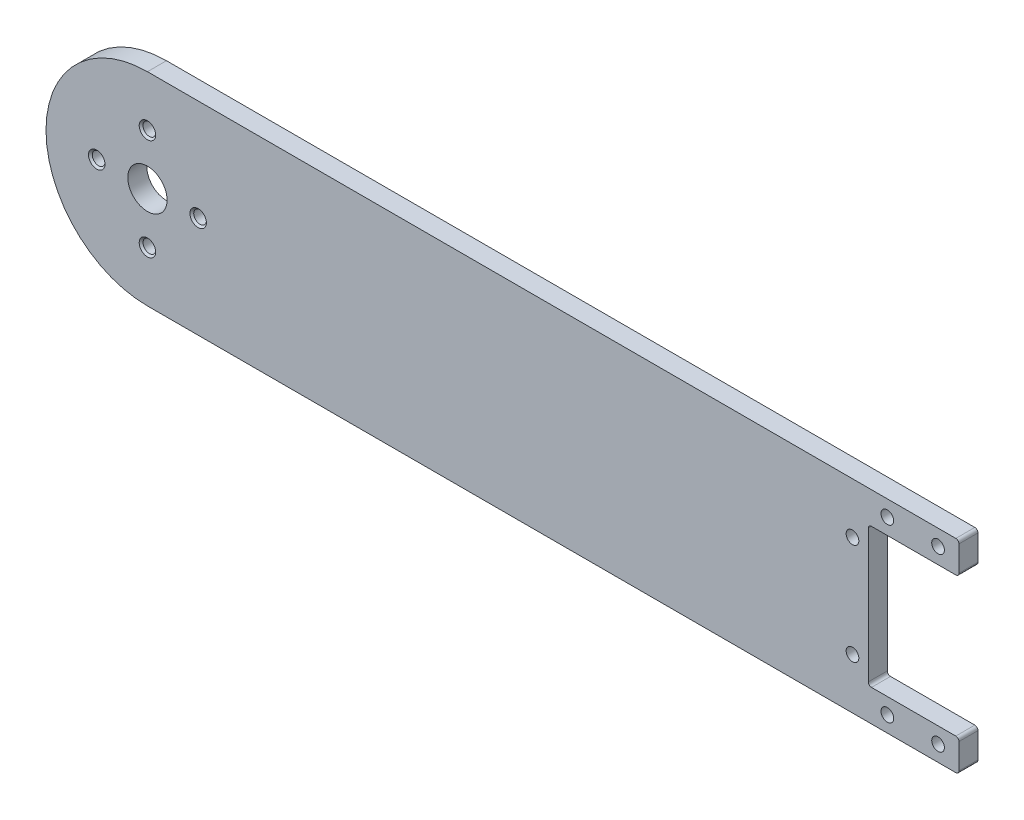
ISO-10303-21;
HEADER;
FILE_DESCRIPTION(('STEP AP214'),'2;1');
FILE_NAME('part.step','',(''),(''),'','','');
FILE_SCHEMA(('AUTOMOTIVE_DESIGN { 1 0 10303 214 1 1 1 1 }'));
ENDSEC;
DATA;
#1=APPLICATION_CONTEXT('core data for automotive mechanical design processes');
#2=APPLICATION_PROTOCOL_DEFINITION('international standard','automotive_design',2000,#1);
#3=PRODUCT_CONTEXT('',#1,'mechanical');
#4=PRODUCT('Part','Part','',(#3));
#5=PRODUCT_RELATED_PRODUCT_CATEGORY('part','',(#4));
#6=PRODUCT_DEFINITION_FORMATION('','',#4);
#7=PRODUCT_DEFINITION_CONTEXT('part definition',#1,'design');
#8=PRODUCT_DEFINITION('design','',#6,#7);
#9=PRODUCT_DEFINITION_SHAPE('','',#8);
#10=(LENGTH_UNIT() NAMED_UNIT(*) SI_UNIT(.MILLI.,.METRE.));
#11=(NAMED_UNIT(*) PLANE_ANGLE_UNIT() SI_UNIT($,.RADIAN.));
#12=(NAMED_UNIT(*) SI_UNIT($,.STERADIAN.) SOLID_ANGLE_UNIT());
#13=UNCERTAINTY_MEASURE_WITH_UNIT(LENGTH_MEASURE(1.E-05),#10,'distance_accuracy_value','');
#14=(GEOMETRIC_REPRESENTATION_CONTEXT(3) GLOBAL_UNCERTAINTY_ASSIGNED_CONTEXT((#13)) GLOBAL_UNIT_ASSIGNED_CONTEXT((#10,
#11,#12)) REPRESENTATION_CONTEXT('',''));
#15=CARTESIAN_POINT('',(0.,0.,0.));
#16=DIRECTION('',(0.,0.,1.));
#17=DIRECTION('',(1.,0.,0.));
#18=AXIS2_PLACEMENT_3D('',#15,#16,#17);
#19=CARTESIAN_POINT('',(0.,0.,3.));
#20=DIRECTION('',(0.,0.,1.));
#21=DIRECTION('',(1.,0.,0.));
#22=AXIS2_PLACEMENT_3D('',#19,#20,#21);
#23=PLANE('',#22);
#24=DIRECTION('',(1.,0.,0.));
#25=VECTOR('',#24,1.);
#26=CARTESIAN_POINT('',(0.,-16.,3.));
#27=LINE('',#26,#25);
#28=CARTESIAN_POINT('',(-61.,-16.,3.));
#29=VERTEX_POINT('',#28);
#30=CARTESIAN_POINT('',(66.4999999999998,-16.,3.));
#31=VERTEX_POINT('',#30);
#32=EDGE_CURVE('E230',#29,#31,#27,.T.);
#33=ORIENTED_EDGE('',*,*,#32,.T.);
#34=CARTESIAN_POINT('',(66.4999999999998,-15.5,3.));
#35=DIRECTION('',(0.,0.,1.));
#36=DIRECTION('',(1.,0.,0.));
#37=AXIS2_PLACEMENT_3D('',#34,#35,#36);
#38=CIRCLE('',#37,0.5);
#39=CARTESIAN_POINT('',(66.9999999999998,-15.5,3.));
#40=VERTEX_POINT('',#39);
#41=EDGE_CURVE('E278',#31,#40,#38,.T.);
#42=ORIENTED_EDGE('',*,*,#41,.T.);
#43=DIRECTION('',(0.,-1.,0.));
#44=VECTOR('',#43,1.);
#45=CARTESIAN_POINT('',(66.9999999999998,0.,3.));
#46=LINE('',#45,#44);
#47=CARTESIAN_POINT('',(66.9999999999998,-11.5,3.));
#48=VERTEX_POINT('',#47);
#49=EDGE_CURVE('E454',#48,#40,#46,.T.);
#50=ORIENTED_EDGE('',*,*,#49,.F.);
#51=CARTESIAN_POINT('',(66.4999999999998,-11.5,3.));
#52=DIRECTION('',(0.,0.,1.));
#53=DIRECTION('',(1.,0.,0.));
#54=AXIS2_PLACEMENT_3D('',#51,#52,#53);
#55=CIRCLE('',#54,0.5);
#56=CARTESIAN_POINT('',(66.4999999999998,-11.,3.));
#57=VERTEX_POINT('',#56);
#58=EDGE_CURVE('E276',#48,#57,#55,.T.);
#59=ORIENTED_EDGE('',*,*,#58,.T.);
#60=DIRECTION('',(1.,0.,0.));
#61=VECTOR('',#60,1.);
#62=CARTESIAN_POINT('',(74.9999999999998,-11.,3.));
#63=LINE('',#62,#61);
#64=CARTESIAN_POINT('',(53.1999999999998,-11.,3.));
#65=VERTEX_POINT('',#64);
#66=EDGE_CURVE('E294',#65,#57,#63,.T.);
#67=ORIENTED_EDGE('',*,*,#66,.F.);
#68=CARTESIAN_POINT('',(53.1999999999998,-10.5,3.));
#69=DIRECTION('',(0.,0.,1.));
#70=DIRECTION('',(1.,0.,0.));
#71=AXIS2_PLACEMENT_3D('',#68,#69,#70);
#72=CIRCLE('',#71,0.5);
#73=CARTESIAN_POINT('',(52.6999999999998,-10.5,3.));
#74=VERTEX_POINT('',#73);
#75=EDGE_CURVE('E116',#65,#74,#72,.F.);
#76=ORIENTED_EDGE('',*,*,#75,.T.);
#77=DIRECTION('',(0.,-1.,0.));
#78=VECTOR('',#77,1.);
#79=CARTESIAN_POINT('',(52.6999999999998,11.,3.));
#80=LINE('',#79,#78);
#81=CARTESIAN_POINT('',(52.6999999999998,10.5,3.));
#82=VERTEX_POINT('',#81);
#83=EDGE_CURVE('E292',#82,#74,#80,.T.);
#84=ORIENTED_EDGE('',*,*,#83,.F.);
#85=CARTESIAN_POINT('',(53.1999999999998,10.5,3.));
#86=DIRECTION('',(0.,0.,1.));
#87=DIRECTION('',(1.,0.,0.));
#88=AXIS2_PLACEMENT_3D('',#85,#86,#87);
#89=CIRCLE('',#88,0.5);
#90=CARTESIAN_POINT('',(53.1999999999998,11.,3.));
#91=VERTEX_POINT('',#90);
#92=EDGE_CURVE('E286',#82,#91,#89,.F.);
#93=ORIENTED_EDGE('',*,*,#92,.T.);
#94=DIRECTION('',(-1.,0.,0.));
#95=VECTOR('',#94,1.);
#96=CARTESIAN_POINT('',(74.9999999999998,11.,3.));
#97=LINE('',#96,#95);
#98=CARTESIAN_POINT('',(66.4999999999998,11.,3.));
#99=VERTEX_POINT('',#98);
#100=EDGE_CURVE('E303',#99,#91,#97,.T.);
#101=ORIENTED_EDGE('',*,*,#100,.F.);
#102=CARTESIAN_POINT('',(66.4999999999998,11.5,3.));
#103=DIRECTION('',(0.,0.,1.));
#104=DIRECTION('',(1.,0.,0.));
#105=AXIS2_PLACEMENT_3D('',#102,#103,#104);
#106=CIRCLE('',#105,0.5);
#107=CARTESIAN_POINT('',(66.9999999999998,11.5,3.));
#108=VERTEX_POINT('',#107);
#109=EDGE_CURVE('E129',#99,#108,#106,.T.);
#110=ORIENTED_EDGE('',*,*,#109,.T.);
#111=CARTESIAN_POINT('',(66.9999999999998,15.5,3.));
#112=VERTEX_POINT('',#111);
#113=EDGE_CURVE('E449',#112,#108,#46,.T.);
#114=ORIENTED_EDGE('',*,*,#113,.F.);
#115=CARTESIAN_POINT('',(66.4999999999998,15.5,3.));
#116=DIRECTION('',(0.,0.,1.));
#117=DIRECTION('',(1.,0.,0.));
#118=AXIS2_PLACEMENT_3D('',#115,#116,#117);
#119=CIRCLE('',#118,0.5);
#120=CARTESIAN_POINT('',(66.4999999999998,16.,3.));
#121=VERTEX_POINT('',#120);
#122=EDGE_CURVE('E123',#112,#121,#119,.T.);
#123=ORIENTED_EDGE('',*,*,#122,.T.);
#124=DIRECTION('',(1.,0.,0.));
#125=VECTOR('',#124,1.);
#126=CARTESIAN_POINT('',(0.,16.,3.));
#127=LINE('',#126,#125);
#128=CARTESIAN_POINT('',(-61.,16.,3.));
#129=VERTEX_POINT('',#128);
#130=EDGE_CURVE('E212',#129,#121,#127,.T.);
#131=ORIENTED_EDGE('',*,*,#130,.F.);
#132=CARTESIAN_POINT('',(-61.,0.,3.));
#133=DIRECTION('',(0.,0.,1.));
#134=DIRECTION('',(1.,0.,0.));
#135=AXIS2_PLACEMENT_3D('',#132,#133,#134);
#136=CIRCLE('',#135,16.);
#137=EDGE_CURVE('E223',#129,#29,#136,.T.);
#138=ORIENTED_EDGE('',*,*,#137,.T.);
#139=EDGE_LOOP('',(#33,#42,#50,#59,#67,#76,#84,#93,#101,#110,#114,#123,#131,#138));
#140=FACE_BOUND('',#139,.T.);
#141=CARTESIAN_POINT('',(50.1999999999998,-8.,3.));
#142=DIRECTION('',(0.,0.,-1.));
#143=DIRECTION('',(-1.,0.,0.));
#144=AXIS2_PLACEMENT_3D('',#141,#142,#143);
#145=CIRCLE('',#144,1.);
#146=CARTESIAN_POINT('',(49.1999999999998,-8.,3.));
#147=VERTEX_POINT('',#146);
#148=EDGE_CURVE('E411',#147,#147,#145,.T.);
#149=ORIENTED_EDGE('',*,*,#148,.T.);
#150=EDGE_LOOP('',(#149));
#151=FACE_BOUND('',#150,.T.);
#152=CARTESIAN_POINT('',(55.6999999999998,-13.5,3.));
#153=DIRECTION('',(0.,0.,-1.));
#154=DIRECTION('',(-1.,0.,0.));
#155=AXIS2_PLACEMENT_3D('',#152,#153,#154);
#156=CIRCLE('',#155,1.);
#157=CARTESIAN_POINT('',(54.6999999999998,-13.5,3.));
#158=VERTEX_POINT('',#157);
#159=EDGE_CURVE('E420',#158,#158,#156,.T.);
#160=ORIENTED_EDGE('',*,*,#159,.T.);
#161=EDGE_LOOP('',(#160));
#162=FACE_BOUND('',#161,.T.);
#163=CARTESIAN_POINT('',(63.6999999999998,-13.5,3.));
#164=DIRECTION('',(0.,0.,-1.));
#165=DIRECTION('',(-1.,0.,0.));
#166=AXIS2_PLACEMENT_3D('',#163,#164,#165);
#167=CIRCLE('',#166,1.);
#168=CARTESIAN_POINT('',(62.6999999999998,-13.5,3.));
#169=VERTEX_POINT('',#168);
#170=EDGE_CURVE('E327',#169,#169,#167,.T.);
#171=ORIENTED_EDGE('',*,*,#170,.T.);
#172=EDGE_LOOP('',(#171));
#173=FACE_BOUND('',#172,.T.);
#174=CARTESIAN_POINT('',(-61.,8.,3.));
#175=DIRECTION('',(0.,0.,1.));
#176=DIRECTION('',(1.,0.,0.));
#177=AXIS2_PLACEMENT_3D('',#174,#175,#176);
#178=CIRCLE('',#177,1.3);
#179=CARTESIAN_POINT('',(-59.7,8.,3.));
#180=VERTEX_POINT('',#179);
#181=EDGE_CURVE('E317',#180,#180,#178,.T.);
#182=ORIENTED_EDGE('',*,*,#181,.F.);
#183=EDGE_LOOP('',(#182));
#184=FACE_BOUND('',#183,.T.);
#185=CARTESIAN_POINT('',(-53.,0.,3.));
#186=DIRECTION('',(0.,0.,1.));
#187=DIRECTION('',(1.,0.,0.));
#188=AXIS2_PLACEMENT_3D('',#185,#186,#187);
#189=CIRCLE('',#188,1.3);
#190=CARTESIAN_POINT('',(-51.7,0.,3.));
#191=VERTEX_POINT('',#190);
#192=EDGE_CURVE('E335',#191,#191,#189,.T.);
#193=ORIENTED_EDGE('',*,*,#192,.F.);
#194=EDGE_LOOP('',(#193));
#195=FACE_BOUND('',#194,.T.);
#196=CARTESIAN_POINT('',(-61.,-8.,3.));
#197=DIRECTION('',(0.,0.,1.));
#198=DIRECTION('',(1.,0.,0.));
#199=AXIS2_PLACEMENT_3D('',#196,#197,#198);
#200=CIRCLE('',#199,1.3);
#201=CARTESIAN_POINT('',(-59.7,-8.,3.));
#202=VERTEX_POINT('',#201);
#203=EDGE_CURVE('E344',#202,#202,#200,.T.);
#204=ORIENTED_EDGE('',*,*,#203,.F.);
#205=EDGE_LOOP('',(#204));
#206=FACE_BOUND('',#205,.T.);
#207=CARTESIAN_POINT('',(-69.,0.,3.));
#208=DIRECTION('',(0.,0.,1.));
#209=DIRECTION('',(1.,0.,0.));
#210=AXIS2_PLACEMENT_3D('',#207,#208,#209);
#211=CIRCLE('',#210,1.3);
#212=CARTESIAN_POINT('',(-67.7,0.,3.));
#213=VERTEX_POINT('',#212);
#214=EDGE_CURVE('E353',#213,#213,#211,.T.);
#215=ORIENTED_EDGE('',*,*,#214,.F.);
#216=EDGE_LOOP('',(#215));
#217=FACE_BOUND('',#216,.T.);
#218=CARTESIAN_POINT('',(-61.,0.,3.));
#219=DIRECTION('',(0.,0.,1.));
#220=DIRECTION('',(1.,0.,0.));
#221=AXIS2_PLACEMENT_3D('',#218,#219,#220);
#222=CIRCLE('',#221,3.1);
#223=CARTESIAN_POINT('',(-57.9,0.,3.));
#224=VERTEX_POINT('',#223);
#225=EDGE_CURVE('E237',#224,#224,#222,.T.);
#226=ORIENTED_EDGE('',*,*,#225,.F.);
#227=EDGE_LOOP('',(#226));
#228=FACE_BOUND('',#227,.T.);
#229=CARTESIAN_POINT('',(50.1999999999998,8.,3.));
#230=DIRECTION('',(0.,0.,-1.));
#231=DIRECTION('',(-1.,0.,0.));
#232=AXIS2_PLACEMENT_3D('',#229,#230,#231);
#233=CIRCLE('',#232,1.);
#234=CARTESIAN_POINT('',(49.1999999999998,8.,3.));
#235=VERTEX_POINT('',#234);
#236=EDGE_CURVE('E375',#235,#235,#233,.T.);
#237=ORIENTED_EDGE('',*,*,#236,.T.);
#238=EDGE_LOOP('',(#237));
#239=FACE_BOUND('',#238,.T.);
#240=CARTESIAN_POINT('',(55.6999999999998,13.5,3.));
#241=DIRECTION('',(0.,0.,-1.));
#242=DIRECTION('',(-1.,0.,0.));
#243=AXIS2_PLACEMENT_3D('',#240,#241,#242);
#244=CIRCLE('',#243,1.);
#245=CARTESIAN_POINT('',(54.6999999999998,13.5,3.));
#246=VERTEX_POINT('',#245);
#247=EDGE_CURVE('E379',#246,#246,#244,.T.);
#248=ORIENTED_EDGE('',*,*,#247,.T.);
#249=EDGE_LOOP('',(#248));
#250=FACE_BOUND('',#249,.T.);
#251=CARTESIAN_POINT('',(63.6999999999998,13.5,3.));
#252=DIRECTION('',(0.,0.,-1.));
#253=DIRECTION('',(-1.,0.,0.));
#254=AXIS2_PLACEMENT_3D('',#251,#252,#253);
#255=CIRCLE('',#254,1.);
#256=CARTESIAN_POINT('',(62.6999999999998,13.5,3.));
#257=VERTEX_POINT('',#256);
#258=EDGE_CURVE('E382',#257,#257,#255,.T.);
#259=ORIENTED_EDGE('',*,*,#258,.T.);
#260=EDGE_LOOP('',(#259));
#261=FACE_BOUND('',#260,.T.);
#262=ADVANCED_FACE('F108',(#140,#151,#162,#173,#184,#195,#206,#217,#228,#239,#250,#261),#23,.T.);
#263=CARTESIAN_POINT('',(0.,16.,3.));
#264=DIRECTION('',(0.,1.,0.));
#265=DIRECTION('',(0.,0.,1.));
#266=AXIS2_PLACEMENT_3D('',#263,#264,#265);
#267=PLANE('',#266);
#268=ORIENTED_EDGE('',*,*,#130,.T.);
#269=DIRECTION('',(0.,0.,-1.));
#270=VECTOR('',#269,1.);
#271=CARTESIAN_POINT('',(66.4999999999998,16.,0.));
#272=LINE('',#271,#270);
#273=CARTESIAN_POINT('',(66.4999999999998,16.,0.));
#274=VERTEX_POINT('',#273);
#275=EDGE_CURVE('E284',#121,#274,#272,.T.);
#276=ORIENTED_EDGE('',*,*,#275,.T.);
#277=DIRECTION('',(1.,0.,0.));
#278=VECTOR('',#277,1.);
#279=CARTESIAN_POINT('',(0.,16.,0.));
#280=LINE('',#279,#278);
#281=CARTESIAN_POINT('',(-61.,16.,0.));
#282=VERTEX_POINT('',#281);
#283=EDGE_CURVE('E215',#282,#274,#280,.T.);
#284=ORIENTED_EDGE('',*,*,#283,.F.);
#285=DIRECTION('',(0.,0.,-1.));
#286=VECTOR('',#285,1.);
#287=CARTESIAN_POINT('',(-61.,16.,3.));
#288=LINE('',#287,#286);
#289=EDGE_CURVE('E208',#129,#282,#288,.T.);
#290=ORIENTED_EDGE('',*,*,#289,.F.);
#291=EDGE_LOOP('',(#268,#276,#284,#290));
#292=FACE_BOUND('',#291,.T.);
#293=ADVANCED_FACE('F210',(#292),#267,.T.);
#294=CARTESIAN_POINT('',(0.,-16.,3.));
#295=DIRECTION('',(0.,1.,0.));
#296=DIRECTION('',(0.,0.,1.));
#297=AXIS2_PLACEMENT_3D('',#294,#295,#296);
#298=PLANE('',#297);
#299=DIRECTION('',(1.,0.,0.));
#300=VECTOR('',#299,1.);
#301=CARTESIAN_POINT('',(0.,-16.,0.));
#302=LINE('',#301,#300);
#303=CARTESIAN_POINT('',(-61.,-16.,0.));
#304=VERTEX_POINT('',#303);
#305=CARTESIAN_POINT('',(66.4999999999998,-16.,0.));
#306=VERTEX_POINT('',#305);
#307=EDGE_CURVE('E231',#304,#306,#302,.T.);
#308=ORIENTED_EDGE('',*,*,#307,.T.);
#309=DIRECTION('',(0.,0.,-1.));
#310=VECTOR('',#309,1.);
#311=CARTESIAN_POINT('',(66.4999999999998,-16.,3.));
#312=LINE('',#311,#310);
#313=EDGE_CURVE('E272',#306,#31,#312,.F.);
#314=ORIENTED_EDGE('',*,*,#313,.T.);
#315=ORIENTED_EDGE('',*,*,#32,.F.);
#316=DIRECTION('',(0.,0.,-1.));
#317=VECTOR('',#316,1.);
#318=CARTESIAN_POINT('',(-61.,-16.,3.));
#319=LINE('',#318,#317);
#320=EDGE_CURVE('E220',#29,#304,#319,.T.);
#321=ORIENTED_EDGE('',*,*,#320,.T.);
#322=EDGE_LOOP('',(#308,#314,#315,#321));
#323=FACE_BOUND('',#322,.T.);
#324=ADVANCED_FACE('F471',(#323),#298,.F.);
#325=CARTESIAN_POINT('',(0.,0.,0.));
#326=DIRECTION('',(0.,0.,1.));
#327=DIRECTION('',(1.,0.,0.));
#328=AXIS2_PLACEMENT_3D('',#325,#326,#327);
#329=PLANE('',#328);
#330=CARTESIAN_POINT('',(63.6999999999998,13.5,0.));
#331=DIRECTION('',(0.,0.,-1.));
#332=DIRECTION('',(-1.,0.,0.));
#333=AXIS2_PLACEMENT_3D('',#330,#331,#332);
#334=CIRCLE('',#333,1.3);
#335=CARTESIAN_POINT('',(62.3999999999998,13.5,0.));
#336=VERTEX_POINT('',#335);
#337=EDGE_CURVE('E391',#336,#336,#334,.T.);
#338=ORIENTED_EDGE('',*,*,#337,.F.);
#339=EDGE_LOOP('',(#338));
#340=FACE_BOUND('',#339,.T.);
#341=CARTESIAN_POINT('',(55.6999999999998,13.5,0.));
#342=DIRECTION('',(0.,0.,-1.));
#343=DIRECTION('',(-1.,0.,0.));
#344=AXIS2_PLACEMENT_3D('',#341,#342,#343);
#345=CIRCLE('',#344,1.3);
#346=CARTESIAN_POINT('',(54.3999999999998,13.5,0.));
#347=VERTEX_POINT('',#346);
#348=EDGE_CURVE('E384',#347,#347,#345,.T.);
#349=ORIENTED_EDGE('',*,*,#348,.F.);
#350=EDGE_LOOP('',(#349));
#351=FACE_BOUND('',#350,.T.);
#352=CARTESIAN_POINT('',(50.1999999999998,8.,0.));
#353=DIRECTION('',(0.,0.,-1.));
#354=DIRECTION('',(-1.,0.,0.));
#355=AXIS2_PLACEMENT_3D('',#352,#353,#354);
#356=CIRCLE('',#355,1.3);
#357=CARTESIAN_POINT('',(48.8999999999998,8.,0.));
#358=VERTEX_POINT('',#357);
#359=EDGE_CURVE('E398',#358,#358,#356,.T.);
#360=ORIENTED_EDGE('',*,*,#359,.F.);
#361=EDGE_LOOP('',(#360));
#362=FACE_BOUND('',#361,.T.);
#363=CARTESIAN_POINT('',(50.1999999999998,-8.,0.));
#364=DIRECTION('',(0.,0.,-1.));
#365=DIRECTION('',(-1.,0.,0.));
#366=AXIS2_PLACEMENT_3D('',#363,#364,#365);
#367=CIRCLE('',#366,1.3);
#368=CARTESIAN_POINT('',(48.8999999999998,-8.,0.));
#369=VERTEX_POINT('',#368);
#370=EDGE_CURVE('E405',#369,#369,#367,.T.);
#371=ORIENTED_EDGE('',*,*,#370,.F.);
#372=EDGE_LOOP('',(#371));
#373=FACE_BOUND('',#372,.T.);
#374=CARTESIAN_POINT('',(55.6999999999998,-13.5,0.));
#375=DIRECTION('',(0.,0.,-1.));
#376=DIRECTION('',(-1.,0.,0.));
#377=AXIS2_PLACEMENT_3D('',#374,#375,#376);
#378=CIRCLE('',#377,1.3);
#379=CARTESIAN_POINT('',(54.3999999999998,-13.5,0.));
#380=VERTEX_POINT('',#379);
#381=EDGE_CURVE('E414',#380,#380,#378,.T.);
#382=ORIENTED_EDGE('',*,*,#381,.F.);
#383=EDGE_LOOP('',(#382));
#384=FACE_BOUND('',#383,.T.);
#385=CARTESIAN_POINT('',(63.6999999999998,-13.5,0.));
#386=DIRECTION('',(0.,0.,-1.));
#387=DIRECTION('',(-1.,0.,0.));
#388=AXIS2_PLACEMENT_3D('',#385,#386,#387);
#389=CIRCLE('',#388,1.3);
#390=CARTESIAN_POINT('',(62.3999999999998,-13.5,0.));
#391=VERTEX_POINT('',#390);
#392=EDGE_CURVE('E423',#391,#391,#389,.T.);
#393=ORIENTED_EDGE('',*,*,#392,.F.);
#394=EDGE_LOOP('',(#393));
#395=FACE_BOUND('',#394,.T.);
#396=CARTESIAN_POINT('',(-61.,8.,0.));
#397=DIRECTION('',(0.,0.,1.));
#398=DIRECTION('',(1.,0.,0.));
#399=AXIS2_PLACEMENT_3D('',#396,#397,#398);
#400=CIRCLE('',#399,1.);
#401=CARTESIAN_POINT('',(-60.,8.,0.));
#402=VERTEX_POINT('',#401);
#403=EDGE_CURVE('E332',#402,#402,#400,.T.);
#404=ORIENTED_EDGE('',*,*,#403,.T.);
#405=EDGE_LOOP('',(#404));
#406=FACE_BOUND('',#405,.T.);
#407=CARTESIAN_POINT('',(-53.,0.,0.));
#408=DIRECTION('',(0.,0.,1.));
#409=DIRECTION('',(1.,0.,0.));
#410=AXIS2_PLACEMENT_3D('',#407,#408,#409);
#411=CIRCLE('',#410,1.);
#412=CARTESIAN_POINT('',(-52.,0.,0.));
#413=VERTEX_POINT('',#412);
#414=EDGE_CURVE('E341',#413,#413,#411,.T.);
#415=ORIENTED_EDGE('',*,*,#414,.T.);
#416=EDGE_LOOP('',(#415));
#417=FACE_BOUND('',#416,.T.);
#418=CARTESIAN_POINT('',(-61.,-8.,0.));
#419=DIRECTION('',(0.,0.,1.));
#420=DIRECTION('',(1.,0.,0.));
#421=AXIS2_PLACEMENT_3D('',#418,#419,#420);
#422=CIRCLE('',#421,1.);
#423=CARTESIAN_POINT('',(-60.,-8.,0.));
#424=VERTEX_POINT('',#423);
#425=EDGE_CURVE('E350',#424,#424,#422,.T.);
#426=ORIENTED_EDGE('',*,*,#425,.T.);
#427=EDGE_LOOP('',(#426));
#428=FACE_BOUND('',#427,.T.);
#429=CARTESIAN_POINT('',(-69.,0.,0.));
#430=DIRECTION('',(0.,0.,1.));
#431=DIRECTION('',(1.,0.,0.));
#432=AXIS2_PLACEMENT_3D('',#429,#430,#431);
#433=CIRCLE('',#432,1.);
#434=CARTESIAN_POINT('',(-68.,0.,0.));
#435=VERTEX_POINT('',#434);
#436=EDGE_CURVE('E359',#435,#435,#433,.T.);
#437=ORIENTED_EDGE('',*,*,#436,.T.);
#438=EDGE_LOOP('',(#437));
#439=FACE_BOUND('',#438,.T.);
#440=CARTESIAN_POINT('',(-61.,0.,0.));
#441=DIRECTION('',(0.,0.,1.));
#442=DIRECTION('',(1.,0.,0.));
#443=AXIS2_PLACEMENT_3D('',#440,#441,#442);
#444=CIRCLE('',#443,3.1);
#445=CARTESIAN_POINT('',(-57.9,0.,0.));
#446=VERTEX_POINT('',#445);
#447=EDGE_CURVE('E243',#446,#446,#444,.T.);
#448=ORIENTED_EDGE('',*,*,#447,.T.);
#449=EDGE_LOOP('',(#448));
#450=FACE_BOUND('',#449,.T.);
#451=DIRECTION('',(0.,1.,0.));
#452=VECTOR('',#451,1.);
#453=CARTESIAN_POINT('',(66.9999999999998,16.,0.));
#454=LINE('',#453,#452);
#455=CARTESIAN_POINT('',(66.9999999999998,-15.5,0.));
#456=VERTEX_POINT('',#455);
#457=CARTESIAN_POINT('',(66.9999999999998,-11.5,0.));
#458=VERTEX_POINT('',#457);
#459=EDGE_CURVE('E450',#456,#458,#454,.T.);
#460=ORIENTED_EDGE('',*,*,#459,.F.);
#461=CARTESIAN_POINT('',(66.4999999999998,-15.5,0.));
#462=DIRECTION('',(0.,0.,1.));
#463=DIRECTION('',(1.,0.,0.));
#464=AXIS2_PLACEMENT_3D('',#461,#462,#463);
#465=CIRCLE('',#464,0.5);
#466=EDGE_CURVE('E270',#456,#306,#465,.F.);
#467=ORIENTED_EDGE('',*,*,#466,.T.);
#468=ORIENTED_EDGE('',*,*,#307,.F.);
#469=CARTESIAN_POINT('',(-61.,0.,0.));
#470=DIRECTION('',(0.,0.,1.));
#471=DIRECTION('',(1.,0.,0.));
#472=AXIS2_PLACEMENT_3D('',#469,#470,#471);
#473=CIRCLE('',#472,16.);
#474=EDGE_CURVE('E227',#282,#304,#473,.T.);
#475=ORIENTED_EDGE('',*,*,#474,.F.);
#476=ORIENTED_EDGE('',*,*,#283,.T.);
#477=CARTESIAN_POINT('',(66.4999999999998,15.5,0.));
#478=DIRECTION('',(0.,0.,1.));
#479=DIRECTION('',(1.,0.,0.));
#480=AXIS2_PLACEMENT_3D('',#477,#478,#479);
#481=CIRCLE('',#480,0.5);
#482=CARTESIAN_POINT('',(66.9999999999998,15.5,0.));
#483=VERTEX_POINT('',#482);
#484=EDGE_CURVE('E264',#274,#483,#481,.F.);
#485=ORIENTED_EDGE('',*,*,#484,.T.);
#486=CARTESIAN_POINT('',(66.9999999999998,11.5,0.));
#487=VERTEX_POINT('',#486);
#488=EDGE_CURVE('E447',#487,#483,#454,.T.);
#489=ORIENTED_EDGE('',*,*,#488,.F.);
#490=CARTESIAN_POINT('',(66.4999999999998,11.5,0.));
#491=DIRECTION('',(0.,0.,1.));
#492=DIRECTION('',(1.,0.,0.));
#493=AXIS2_PLACEMENT_3D('',#490,#491,#492);
#494=CIRCLE('',#493,0.5);
#495=CARTESIAN_POINT('',(66.4999999999998,11.,0.));
#496=VERTEX_POINT('',#495);
#497=EDGE_CURVE('E266',#487,#496,#494,.F.);
#498=ORIENTED_EDGE('',*,*,#497,.T.);
#499=DIRECTION('',(-1.,0.,0.));
#500=VECTOR('',#499,1.);
#501=CARTESIAN_POINT('',(74.9999999999998,11.,0.));
#502=LINE('',#501,#500);
#503=CARTESIAN_POINT('',(53.1999999999998,11.,0.));
#504=VERTEX_POINT('',#503);
#505=EDGE_CURVE('E322',#496,#504,#502,.T.);
#506=ORIENTED_EDGE('',*,*,#505,.T.);
#507=CARTESIAN_POINT('',(53.1999999999998,10.5,0.));
#508=DIRECTION('',(0.,0.,1.));
#509=DIRECTION('',(1.,0.,0.));
#510=AXIS2_PLACEMENT_3D('',#507,#508,#509);
#511=CIRCLE('',#510,0.5);
#512=CARTESIAN_POINT('',(52.6999999999998,10.5,0.));
#513=VERTEX_POINT('',#512);
#514=EDGE_CURVE('E288',#504,#513,#511,.T.);
#515=ORIENTED_EDGE('',*,*,#514,.T.);
#516=DIRECTION('',(0.,-1.,0.));
#517=VECTOR('',#516,1.);
#518=CARTESIAN_POINT('',(52.6999999999998,11.,0.));
#519=LINE('',#518,#517);
#520=CARTESIAN_POINT('',(52.6999999999998,-10.5,0.));
#521=VERTEX_POINT('',#520);
#522=EDGE_CURVE('E313',#513,#521,#519,.T.);
#523=ORIENTED_EDGE('',*,*,#522,.T.);
#524=CARTESIAN_POINT('',(53.1999999999998,-10.5,0.));
#525=DIRECTION('',(0.,0.,1.));
#526=DIRECTION('',(1.,0.,0.));
#527=AXIS2_PLACEMENT_3D('',#524,#525,#526);
#528=CIRCLE('',#527,0.5);
#529=CARTESIAN_POINT('',(53.1999999999998,-11.,0.));
#530=VERTEX_POINT('',#529);
#531=EDGE_CURVE('E12',#521,#530,#528,.T.);
#532=ORIENTED_EDGE('',*,*,#531,.T.);
#533=DIRECTION('',(1.,0.,0.));
#534=VECTOR('',#533,1.);
#535=CARTESIAN_POINT('',(74.9999999999998,-11.,0.));
#536=LINE('',#535,#534);
#537=CARTESIAN_POINT('',(66.4999999999998,-11.,0.));
#538=VERTEX_POINT('',#537);
#539=EDGE_CURVE('E312',#530,#538,#536,.T.);
#540=ORIENTED_EDGE('',*,*,#539,.T.);
#541=CARTESIAN_POINT('',(66.4999999999998,-11.5,0.));
#542=DIRECTION('',(0.,0.,1.));
#543=DIRECTION('',(1.,0.,0.));
#544=AXIS2_PLACEMENT_3D('',#541,#542,#543);
#545=CIRCLE('',#544,0.5);
#546=EDGE_CURVE('E268',#538,#458,#545,.F.);
#547=ORIENTED_EDGE('',*,*,#546,.T.);
#548=EDGE_LOOP('',(#460,#467,#468,#475,#476,#485,#489,#498,#506,#515,#523,#532,#540,#547));
#549=FACE_BOUND('',#548,.T.);
#550=ADVANCED_FACE('F311',(#340,#351,#362,#373,#384,#395,#406,#417,#428,#439,#450,#549),#329,.F.);
#551=CARTESIAN_POINT('',(-61.,0.,3.));
#552=DIRECTION('',(0.,0.,-1.));
#553=DIRECTION('',(-1.,0.,0.));
#554=AXIS2_PLACEMENT_3D('',#551,#552,#553);
#555=CYLINDRICAL_SURFACE('',#554,16.);
#556=ORIENTED_EDGE('',*,*,#137,.F.);
#557=ORIENTED_EDGE('',*,*,#289,.T.);
#558=ORIENTED_EDGE('',*,*,#474,.T.);
#559=ORIENTED_EDGE('',*,*,#320,.F.);
#560=EDGE_LOOP('',(#556,#557,#558,#559));
#561=FACE_BOUND('',#560,.T.);
#562=ADVANCED_FACE('F224',(#561),#555,.T.);
#563=CARTESIAN_POINT('',(-61.,0.,0.));
#564=DIRECTION('',(0.,0.,1.));
#565=DIRECTION('',(1.,0.,0.));
#566=AXIS2_PLACEMENT_3D('',#563,#564,#565);
#567=CYLINDRICAL_SURFACE('',#566,3.1);
#568=ORIENTED_EDGE('',*,*,#447,.F.);
#569=EDGE_LOOP('',(#568));
#570=FACE_BOUND('',#569,.T.);
#571=ORIENTED_EDGE('',*,*,#225,.T.);
#572=EDGE_LOOP('',(#571));
#573=FACE_BOUND('',#572,.T.);
#574=ADVANCED_FACE('F367',(#570,#573),#567,.F.);
#575=CARTESIAN_POINT('',(-69.,0.,3.));
#576=DIRECTION('',(0.,0.,1.));
#577=DIRECTION('',(1.,0.,0.));
#578=AXIS2_PLACEMENT_3D('',#575,#576,#577);
#579=CYLINDRICAL_SURFACE('',#578,1.);
#580=ORIENTED_EDGE('',*,*,#436,.F.);
#581=EDGE_LOOP('',(#580));
#582=FACE_BOUND('',#581,.T.);
#583=CARTESIAN_POINT('',(-69.,0.,2.7));
#584=DIRECTION('',(0.,0.,1.));
#585=DIRECTION('',(1.,0.,0.));
#586=AXIS2_PLACEMENT_3D('',#583,#584,#585);
#587=CIRCLE('',#586,1.);
#588=CARTESIAN_POINT('',(-68.,0.,2.7));
#589=VERTEX_POINT('',#588);
#590=EDGE_CURVE('E356',#589,#589,#587,.T.);
#591=ORIENTED_EDGE('',*,*,#590,.T.);
#592=EDGE_LOOP('',(#591));
#593=FACE_BOUND('',#592,.T.);
#594=ADVANCED_FACE('F781',(#582,#593),#579,.F.);
#595=CARTESIAN_POINT('',(-69.,0.,3.));
#596=DIRECTION('',(0.,0.,1.));
#597=DIRECTION('',(1.,0.,0.));
#598=AXIS2_PLACEMENT_3D('',#595,#596,#597);
#599=CONICAL_SURFACE('',#598,1.3,0.78539816339744);
#600=ORIENTED_EDGE('',*,*,#590,.F.);
#601=EDGE_LOOP('',(#600));
#602=FACE_BOUND('',#601,.T.);
#603=ORIENTED_EDGE('',*,*,#214,.T.);
#604=EDGE_LOOP('',(#603));
#605=FACE_BOUND('',#604,.T.);
#606=ADVANCED_FACE('F771',(#602,#605),#599,.F.);
#607=CARTESIAN_POINT('',(-61.,-8.,3.));
#608=DIRECTION('',(0.,0.,1.));
#609=DIRECTION('',(1.,0.,0.));
#610=AXIS2_PLACEMENT_3D('',#607,#608,#609);
#611=CYLINDRICAL_SURFACE('',#610,1.);
#612=ORIENTED_EDGE('',*,*,#425,.F.);
#613=EDGE_LOOP('',(#612));
#614=FACE_BOUND('',#613,.T.);
#615=CARTESIAN_POINT('',(-61.,-8.,2.7));
#616=DIRECTION('',(0.,0.,1.));
#617=DIRECTION('',(1.,0.,0.));
#618=AXIS2_PLACEMENT_3D('',#615,#616,#617);
#619=CIRCLE('',#618,1.);
#620=CARTESIAN_POINT('',(-60.,-8.,2.7));
#621=VERTEX_POINT('',#620);
#622=EDGE_CURVE('E347',#621,#621,#619,.T.);
#623=ORIENTED_EDGE('',*,*,#622,.T.);
#624=EDGE_LOOP('',(#623));
#625=FACE_BOUND('',#624,.T.);
#626=ADVANCED_FACE('F761',(#614,#625),#611,.F.);
#627=CARTESIAN_POINT('',(-61.,-8.,3.));
#628=DIRECTION('',(0.,0.,1.));
#629=DIRECTION('',(1.,0.,0.));
#630=AXIS2_PLACEMENT_3D('',#627,#628,#629);
#631=CONICAL_SURFACE('',#630,1.3,0.785398163397451);
#632=ORIENTED_EDGE('',*,*,#622,.F.);
#633=EDGE_LOOP('',(#632));
#634=FACE_BOUND('',#633,.T.);
#635=ORIENTED_EDGE('',*,*,#203,.T.);
#636=EDGE_LOOP('',(#635));
#637=FACE_BOUND('',#636,.T.);
#638=ADVANCED_FACE('F751',(#634,#637),#631,.F.);
#639=CARTESIAN_POINT('',(-53.,0.,3.));
#640=DIRECTION('',(0.,0.,1.));
#641=DIRECTION('',(1.,0.,0.));
#642=AXIS2_PLACEMENT_3D('',#639,#640,#641);
#643=CYLINDRICAL_SURFACE('',#642,1.);
#644=ORIENTED_EDGE('',*,*,#414,.F.);
#645=EDGE_LOOP('',(#644));
#646=FACE_BOUND('',#645,.T.);
#647=CARTESIAN_POINT('',(-53.,0.,2.7));
#648=DIRECTION('',(0.,0.,1.));
#649=DIRECTION('',(1.,0.,0.));
#650=AXIS2_PLACEMENT_3D('',#647,#648,#649);
#651=CIRCLE('',#650,1.);
#652=CARTESIAN_POINT('',(-52.,0.,2.7));
#653=VERTEX_POINT('',#652);
#654=EDGE_CURVE('E338',#653,#653,#651,.T.);
#655=ORIENTED_EDGE('',*,*,#654,.T.);
#656=EDGE_LOOP('',(#655));
#657=FACE_BOUND('',#656,.T.);
#658=ADVANCED_FACE('F741',(#646,#657),#643,.F.);
#659=CARTESIAN_POINT('',(-53.,0.,3.));
#660=DIRECTION('',(0.,0.,1.));
#661=DIRECTION('',(1.,0.,0.));
#662=AXIS2_PLACEMENT_3D('',#659,#660,#661);
#663=CONICAL_SURFACE('',#662,1.3,0.785398163397451);
#664=ORIENTED_EDGE('',*,*,#654,.F.);
#665=EDGE_LOOP('',(#664));
#666=FACE_BOUND('',#665,.T.);
#667=ORIENTED_EDGE('',*,*,#192,.T.);
#668=EDGE_LOOP('',(#667));
#669=FACE_BOUND('',#668,.T.);
#670=ADVANCED_FACE('F731',(#666,#669),#663,.F.);
#671=CARTESIAN_POINT('',(-61.,8.,3.));
#672=DIRECTION('',(0.,0.,1.));
#673=DIRECTION('',(1.,0.,0.));
#674=AXIS2_PLACEMENT_3D('',#671,#672,#673);
#675=CYLINDRICAL_SURFACE('',#674,1.);
#676=ORIENTED_EDGE('',*,*,#403,.F.);
#677=EDGE_LOOP('',(#676));
#678=FACE_BOUND('',#677,.T.);
#679=CARTESIAN_POINT('',(-61.,8.,2.7));
#680=DIRECTION('',(0.,0.,1.));
#681=DIRECTION('',(1.,0.,0.));
#682=AXIS2_PLACEMENT_3D('',#679,#680,#681);
#683=CIRCLE('',#682,1.);
#684=CARTESIAN_POINT('',(-60.,8.,2.7));
#685=VERTEX_POINT('',#684);
#686=EDGE_CURVE('E320',#685,#685,#683,.T.);
#687=ORIENTED_EDGE('',*,*,#686,.T.);
#688=EDGE_LOOP('',(#687));
#689=FACE_BOUND('',#688,.T.);
#690=ADVANCED_FACE('F721',(#678,#689),#675,.F.);
#691=CARTESIAN_POINT('',(-61.,8.,3.));
#692=DIRECTION('',(0.,0.,1.));
#693=DIRECTION('',(1.,0.,0.));
#694=AXIS2_PLACEMENT_3D('',#691,#692,#693);
#695=CONICAL_SURFACE('',#694,1.3,0.785398163397451);
#696=ORIENTED_EDGE('',*,*,#686,.F.);
#697=EDGE_LOOP('',(#696));
#698=FACE_BOUND('',#697,.T.);
#699=ORIENTED_EDGE('',*,*,#181,.T.);
#700=EDGE_LOOP('',(#699));
#701=FACE_BOUND('',#700,.T.);
#702=ADVANCED_FACE('F574',(#698,#701),#695,.F.);
#703=CARTESIAN_POINT('',(74.9999999999998,-11.,0.));
#704=DIRECTION('',(0.,-1.,0.));
#705=DIRECTION('',(1.,0.,0.));
#706=AXIS2_PLACEMENT_3D('',#703,#704,#705);
#707=PLANE('',#706);
#708=ORIENTED_EDGE('',*,*,#539,.F.);
#709=DIRECTION('',(0.,0.,1.));
#710=VECTOR('',#709,1.);
#711=CARTESIAN_POINT('',(53.1999999999998,-11.,3.));
#712=LINE('',#711,#710);
#713=EDGE_CURVE('E256',#530,#65,#712,.T.);
#714=ORIENTED_EDGE('',*,*,#713,.T.);
#715=ORIENTED_EDGE('',*,*,#66,.T.);
#716=DIRECTION('',(0.,0.,-1.));
#717=VECTOR('',#716,1.);
#718=CARTESIAN_POINT('',(66.4999999999998,-11.,0.));
#719=LINE('',#718,#717);
#720=EDGE_CURVE('E253',#57,#538,#719,.T.);
#721=ORIENTED_EDGE('',*,*,#720,.T.);
#722=EDGE_LOOP('',(#708,#714,#715,#721));
#723=FACE_BOUND('',#722,.T.);
#724=ADVANCED_FACE('F315',(#723),#707,.F.);
#725=CARTESIAN_POINT('',(52.6999999999998,11.,0.));
#726=DIRECTION('',(-1.,0.,0.));
#727=DIRECTION('',(0.,-1.,0.));
#728=AXIS2_PLACEMENT_3D('',#725,#726,#727);
#729=PLANE('',#728);
#730=ORIENTED_EDGE('',*,*,#522,.F.);
#731=DIRECTION('',(0.,0.,1.));
#732=VECTOR('',#731,1.);
#733=CARTESIAN_POINT('',(52.6999999999998,10.5,3.));
#734=LINE('',#733,#732);
#735=EDGE_CURVE('E245',#513,#82,#734,.T.);
#736=ORIENTED_EDGE('',*,*,#735,.T.);
#737=ORIENTED_EDGE('',*,*,#83,.T.);
#738=DIRECTION('',(0.,0.,1.));
#739=VECTOR('',#738,1.);
#740=CARTESIAN_POINT('',(52.6999999999998,-10.5,0.));
#741=LINE('',#740,#739);
#742=EDGE_CURVE('E219',#74,#521,#741,.F.);
#743=ORIENTED_EDGE('',*,*,#742,.T.);
#744=EDGE_LOOP('',(#730,#736,#737,#743));
#745=FACE_BOUND('',#744,.T.);
#746=ADVANCED_FACE('F300',(#745),#729,.F.);
#747=CARTESIAN_POINT('',(74.9999999999998,11.,0.));
#748=DIRECTION('',(0.,1.,0.));
#749=DIRECTION('',(-1.,0.,0.));
#750=AXIS2_PLACEMENT_3D('',#747,#748,#749);
#751=PLANE('',#750);
#752=ORIENTED_EDGE('',*,*,#100,.T.);
#753=DIRECTION('',(0.,0.,1.));
#754=VECTOR('',#753,1.);
#755=CARTESIAN_POINT('',(53.1999999999998,11.,0.));
#756=LINE('',#755,#754);
#757=EDGE_CURVE('E251',#91,#504,#756,.F.);
#758=ORIENTED_EDGE('',*,*,#757,.T.);
#759=ORIENTED_EDGE('',*,*,#505,.F.);
#760=DIRECTION('',(0.,0.,1.));
#761=VECTOR('',#760,1.);
#762=CARTESIAN_POINT('',(66.4999999999998,11.,0.));
#763=LINE('',#762,#761);
#764=EDGE_CURVE('E248',#496,#99,#763,.T.);
#765=ORIENTED_EDGE('',*,*,#764,.T.);
#766=EDGE_LOOP('',(#752,#758,#759,#765));
#767=FACE_BOUND('',#766,.T.);
#768=ADVANCED_FACE('F440',(#767),#751,.F.);
#769=CARTESIAN_POINT('',(63.6999999999998,-13.5,0.));
#770=DIRECTION('',(0.,0.,-1.));
#771=DIRECTION('',(-1.,0.,0.));
#772=AXIS2_PLACEMENT_3D('',#769,#770,#771);
#773=CYLINDRICAL_SURFACE('',#772,1.);
#774=ORIENTED_EDGE('',*,*,#170,.F.);
#775=EDGE_LOOP('',(#774));
#776=FACE_BOUND('',#775,.T.);
#777=CARTESIAN_POINT('',(63.6999999999998,-13.5,0.3));
#778=DIRECTION('',(0.,0.,-1.));
#779=DIRECTION('',(-1.,0.,0.));
#780=AXIS2_PLACEMENT_3D('',#777,#778,#779);
#781=CIRCLE('',#780,1.);
#782=CARTESIAN_POINT('',(62.6999999999998,-13.5,0.3));
#783=VERTEX_POINT('',#782);
#784=EDGE_CURVE('E426',#783,#783,#781,.T.);
#785=ORIENTED_EDGE('',*,*,#784,.T.);
#786=EDGE_LOOP('',(#785));
#787=FACE_BOUND('',#786,.T.);
#788=ADVANCED_FACE('F555',(#776,#787),#773,.F.);
#789=CARTESIAN_POINT('',(63.6999999999998,-13.5,0.));
#790=DIRECTION('',(0.,0.,-1.));
#791=DIRECTION('',(-1.,0.,0.));
#792=AXIS2_PLACEMENT_3D('',#789,#790,#791);
#793=CONICAL_SURFACE('',#792,1.3,0.785398163397436);
#794=ORIENTED_EDGE('',*,*,#784,.F.);
#795=EDGE_LOOP('',(#794));
#796=FACE_BOUND('',#795,.T.);
#797=ORIENTED_EDGE('',*,*,#392,.T.);
#798=EDGE_LOOP('',(#797));
#799=FACE_BOUND('',#798,.T.);
#800=ADVANCED_FACE('F697',(#796,#799),#793,.F.);
#801=CARTESIAN_POINT('',(55.6999999999998,-13.5,0.));
#802=DIRECTION('',(0.,0.,-1.));
#803=DIRECTION('',(-1.,0.,0.));
#804=AXIS2_PLACEMENT_3D('',#801,#802,#803);
#805=CYLINDRICAL_SURFACE('',#804,1.);
#806=ORIENTED_EDGE('',*,*,#159,.F.);
#807=EDGE_LOOP('',(#806));
#808=FACE_BOUND('',#807,.T.);
#809=CARTESIAN_POINT('',(55.6999999999998,-13.5,0.3));
#810=DIRECTION('',(0.,0.,-1.));
#811=DIRECTION('',(-1.,0.,0.));
#812=AXIS2_PLACEMENT_3D('',#809,#810,#811);
#813=CIRCLE('',#812,1.);
#814=CARTESIAN_POINT('',(54.6999999999998,-13.5,0.3));
#815=VERTEX_POINT('',#814);
#816=EDGE_CURVE('E417',#815,#815,#813,.T.);
#817=ORIENTED_EDGE('',*,*,#816,.T.);
#818=EDGE_LOOP('',(#817));
#819=FACE_BOUND('',#818,.T.);
#820=ADVANCED_FACE('F687',(#808,#819),#805,.F.);
#821=CARTESIAN_POINT('',(55.6999999999998,-13.5,0.));
#822=DIRECTION('',(0.,0.,-1.));
#823=DIRECTION('',(-1.,0.,0.));
#824=AXIS2_PLACEMENT_3D('',#821,#822,#823);
#825=CONICAL_SURFACE('',#824,1.3,0.785398163397448);
#826=ORIENTED_EDGE('',*,*,#816,.F.);
#827=EDGE_LOOP('',(#826));
#828=FACE_BOUND('',#827,.T.);
#829=ORIENTED_EDGE('',*,*,#381,.T.);
#830=EDGE_LOOP('',(#829));
#831=FACE_BOUND('',#830,.T.);
#832=ADVANCED_FACE('F677',(#828,#831),#825,.F.);
#833=CARTESIAN_POINT('',(50.1999999999998,-8.,0.));
#834=DIRECTION('',(0.,0.,-1.));
#835=DIRECTION('',(-1.,0.,0.));
#836=AXIS2_PLACEMENT_3D('',#833,#834,#835);
#837=CYLINDRICAL_SURFACE('',#836,1.);
#838=ORIENTED_EDGE('',*,*,#148,.F.);
#839=EDGE_LOOP('',(#838));
#840=FACE_BOUND('',#839,.T.);
#841=CARTESIAN_POINT('',(50.1999999999998,-8.,0.3));
#842=DIRECTION('',(0.,0.,-1.));
#843=DIRECTION('',(-1.,0.,0.));
#844=AXIS2_PLACEMENT_3D('',#841,#842,#843);
#845=CIRCLE('',#844,1.);
#846=CARTESIAN_POINT('',(49.1999999999998,-8.,0.3));
#847=VERTEX_POINT('',#846);
#848=EDGE_CURVE('E408',#847,#847,#845,.T.);
#849=ORIENTED_EDGE('',*,*,#848,.T.);
#850=EDGE_LOOP('',(#849));
#851=FACE_BOUND('',#850,.T.);
#852=ADVANCED_FACE('F667',(#840,#851),#837,.F.);
#853=CARTESIAN_POINT('',(50.1999999999998,-8.,0.));
#854=DIRECTION('',(0.,0.,-1.));
#855=DIRECTION('',(-1.,0.,0.));
#856=AXIS2_PLACEMENT_3D('',#853,#854,#855);
#857=CONICAL_SURFACE('',#856,1.3,0.785398163397448);
#858=ORIENTED_EDGE('',*,*,#848,.F.);
#859=EDGE_LOOP('',(#858));
#860=FACE_BOUND('',#859,.T.);
#861=ORIENTED_EDGE('',*,*,#370,.T.);
#862=EDGE_LOOP('',(#861));
#863=FACE_BOUND('',#862,.T.);
#864=ADVANCED_FACE('F657',(#860,#863),#857,.F.);
#865=CARTESIAN_POINT('',(50.1999999999998,8.,0.));
#866=DIRECTION('',(0.,0.,-1.));
#867=DIRECTION('',(-1.,0.,0.));
#868=AXIS2_PLACEMENT_3D('',#865,#866,#867);
#869=CYLINDRICAL_SURFACE('',#868,1.);
#870=ORIENTED_EDGE('',*,*,#236,.F.);
#871=EDGE_LOOP('',(#870));
#872=FACE_BOUND('',#871,.T.);
#873=CARTESIAN_POINT('',(50.1999999999998,8.,0.3));
#874=DIRECTION('',(0.,0.,-1.));
#875=DIRECTION('',(-1.,0.,0.));
#876=AXIS2_PLACEMENT_3D('',#873,#874,#875);
#877=CIRCLE('',#876,1.);
#878=CARTESIAN_POINT('',(49.1999999999998,8.,0.3));
#879=VERTEX_POINT('',#878);
#880=EDGE_CURVE('E401',#879,#879,#877,.T.);
#881=ORIENTED_EDGE('',*,*,#880,.T.);
#882=EDGE_LOOP('',(#881));
#883=FACE_BOUND('',#882,.T.);
#884=ADVANCED_FACE('F647',(#872,#883),#869,.F.);
#885=CARTESIAN_POINT('',(50.1999999999998,8.,0.));
#886=DIRECTION('',(0.,0.,-1.));
#887=DIRECTION('',(-1.,0.,0.));
#888=AXIS2_PLACEMENT_3D('',#885,#886,#887);
#889=CONICAL_SURFACE('',#888,1.3,0.785398163397448);
#890=ORIENTED_EDGE('',*,*,#880,.F.);
#891=EDGE_LOOP('',(#890));
#892=FACE_BOUND('',#891,.T.);
#893=ORIENTED_EDGE('',*,*,#359,.T.);
#894=EDGE_LOOP('',(#893));
#895=FACE_BOUND('',#894,.T.);
#896=ADVANCED_FACE('F637',(#892,#895),#889,.F.);
#897=CARTESIAN_POINT('',(55.6999999999998,13.5,0.));
#898=DIRECTION('',(0.,0.,-1.));
#899=DIRECTION('',(-1.,0.,0.));
#900=AXIS2_PLACEMENT_3D('',#897,#898,#899);
#901=CYLINDRICAL_SURFACE('',#900,1.);
#902=ORIENTED_EDGE('',*,*,#247,.F.);
#903=EDGE_LOOP('',(#902));
#904=FACE_BOUND('',#903,.T.);
#905=CARTESIAN_POINT('',(55.6999999999998,13.5,0.3));
#906=DIRECTION('',(0.,0.,-1.));
#907=DIRECTION('',(-1.,0.,0.));
#908=AXIS2_PLACEMENT_3D('',#905,#906,#907);
#909=CIRCLE('',#908,1.);
#910=CARTESIAN_POINT('',(54.6999999999998,13.5,0.3));
#911=VERTEX_POINT('',#910);
#912=EDGE_CURVE('E388',#911,#911,#909,.T.);
#913=ORIENTED_EDGE('',*,*,#912,.T.);
#914=EDGE_LOOP('',(#913));
#915=FACE_BOUND('',#914,.T.);
#916=ADVANCED_FACE('F627',(#904,#915),#901,.F.);
#917=CARTESIAN_POINT('',(55.6999999999998,13.5,0.));
#918=DIRECTION('',(0.,0.,-1.));
#919=DIRECTION('',(-1.,0.,0.));
#920=AXIS2_PLACEMENT_3D('',#917,#918,#919);
#921=CONICAL_SURFACE('',#920,1.3,0.785398163397448);
#922=ORIENTED_EDGE('',*,*,#912,.F.);
#923=EDGE_LOOP('',(#922));
#924=FACE_BOUND('',#923,.T.);
#925=ORIENTED_EDGE('',*,*,#348,.T.);
#926=EDGE_LOOP('',(#925));
#927=FACE_BOUND('',#926,.T.);
#928=ADVANCED_FACE('F618',(#924,#927),#921,.F.);
#929=CARTESIAN_POINT('',(63.6999999999998,13.5,0.));
#930=DIRECTION('',(0.,0.,-1.));
#931=DIRECTION('',(-1.,0.,0.));
#932=AXIS2_PLACEMENT_3D('',#929,#930,#931);
#933=CYLINDRICAL_SURFACE('',#932,1.);
#934=ORIENTED_EDGE('',*,*,#258,.F.);
#935=EDGE_LOOP('',(#934));
#936=FACE_BOUND('',#935,.T.);
#937=CARTESIAN_POINT('',(63.6999999999998,13.5,0.3));
#938=DIRECTION('',(0.,0.,-1.));
#939=DIRECTION('',(-1.,0.,0.));
#940=AXIS2_PLACEMENT_3D('',#937,#938,#939);
#941=CIRCLE('',#940,1.);
#942=CARTESIAN_POINT('',(62.6999999999998,13.5,0.3));
#943=VERTEX_POINT('',#942);
#944=EDGE_CURVE('E385',#943,#943,#941,.T.);
#945=ORIENTED_EDGE('',*,*,#944,.T.);
#946=EDGE_LOOP('',(#945));
#947=FACE_BOUND('',#946,.T.);
#948=ADVANCED_FACE('F608',(#936,#947),#933,.F.);
#949=CARTESIAN_POINT('',(63.6999999999998,13.5,0.));
#950=DIRECTION('',(0.,0.,-1.));
#951=DIRECTION('',(-1.,0.,0.));
#952=AXIS2_PLACEMENT_3D('',#949,#950,#951);
#953=CONICAL_SURFACE('',#952,1.3,0.785398163397436);
#954=ORIENTED_EDGE('',*,*,#944,.F.);
#955=EDGE_LOOP('',(#954));
#956=FACE_BOUND('',#955,.T.);
#957=ORIENTED_EDGE('',*,*,#337,.T.);
#958=EDGE_LOOP('',(#957));
#959=FACE_BOUND('',#958,.T.);
#960=ADVANCED_FACE('F545',(#956,#959),#953,.F.);
#961=CARTESIAN_POINT('',(66.9999999999998,16.,10.));
#962=DIRECTION('',(-1.,0.,0.));
#963=DIRECTION('',(0.,0.,1.));
#964=AXIS2_PLACEMENT_3D('',#961,#962,#963);
#965=PLANE('',#964);
#966=ORIENTED_EDGE('',*,*,#113,.T.);
#967=DIRECTION('',(0.,0.,1.));
#968=VECTOR('',#967,1.);
#969=CARTESIAN_POINT('',(66.9999999999998,11.5,10.));
#970=LINE('',#969,#968);
#971=EDGE_CURVE('E282',#108,#487,#970,.F.);
#972=ORIENTED_EDGE('',*,*,#971,.T.);
#973=ORIENTED_EDGE('',*,*,#488,.T.);
#974=DIRECTION('',(0.,0.,-1.));
#975=VECTOR('',#974,1.);
#976=CARTESIAN_POINT('',(66.9999999999998,15.5,3.));
#977=LINE('',#976,#975);
#978=EDGE_CURVE('E280',#483,#112,#977,.F.);
#979=ORIENTED_EDGE('',*,*,#978,.T.);
#980=EDGE_LOOP('',(#966,#972,#973,#979));
#981=FACE_BOUND('',#980,.T.);
#982=ADVANCED_FACE('F446',(#981),#965,.F.);
#983=ORIENTED_EDGE('',*,*,#49,.T.);
#984=DIRECTION('',(0.,0.,-1.));
#985=VECTOR('',#984,1.);
#986=CARTESIAN_POINT('',(66.9999999999998,-15.5,10.));
#987=LINE('',#986,#985);
#988=EDGE_CURVE('E261',#40,#456,#987,.T.);
#989=ORIENTED_EDGE('',*,*,#988,.T.);
#990=ORIENTED_EDGE('',*,*,#459,.T.);
#991=DIRECTION('',(0.,0.,-1.));
#992=VECTOR('',#991,1.);
#993=CARTESIAN_POINT('',(66.9999999999998,-11.5,10.));
#994=LINE('',#993,#992);
#995=EDGE_CURVE('E259',#458,#48,#994,.F.);
#996=ORIENTED_EDGE('',*,*,#995,.T.);
#997=EDGE_LOOP('',(#983,#989,#990,#996));
#998=FACE_BOUND('',#997,.T.);
#999=ADVANCED_FACE('F462',(#998),#965,.F.);
#1000=CARTESIAN_POINT('',(53.1999999999998,10.5,0.));
#1001=DIRECTION('',(0.,0.,-1.));
#1002=DIRECTION('',(-1.,0.,0.));
#1003=AXIS2_PLACEMENT_3D('',#1000,#1001,#1002);
#1004=CYLINDRICAL_SURFACE('',#1003,0.5);
#1005=ORIENTED_EDGE('',*,*,#514,.F.);
#1006=ORIENTED_EDGE('',*,*,#757,.F.);
#1007=ORIENTED_EDGE('',*,*,#92,.F.);
#1008=ORIENTED_EDGE('',*,*,#735,.F.);
#1009=EDGE_LOOP('',(#1005,#1006,#1007,#1008));
#1010=FACE_BOUND('',#1009,.T.);
#1011=ADVANCED_FACE('F439',(#1010),#1004,.F.);
#1012=CARTESIAN_POINT('',(53.1999999999998,-10.5,0.));
#1013=DIRECTION('',(0.,0.,-1.));
#1014=DIRECTION('',(-1.,0.,0.));
#1015=AXIS2_PLACEMENT_3D('',#1012,#1013,#1014);
#1016=CYLINDRICAL_SURFACE('',#1015,0.5);
#1017=ORIENTED_EDGE('',*,*,#531,.F.);
#1018=ORIENTED_EDGE('',*,*,#742,.F.);
#1019=ORIENTED_EDGE('',*,*,#75,.F.);
#1020=ORIENTED_EDGE('',*,*,#713,.F.);
#1021=EDGE_LOOP('',(#1017,#1018,#1019,#1020));
#1022=FACE_BOUND('',#1021,.T.);
#1023=ADVANCED_FACE('F306',(#1022),#1016,.F.);
#1024=CARTESIAN_POINT('',(66.4999999999998,-15.5,10.));
#1025=DIRECTION('',(0.,0.,-1.));
#1026=DIRECTION('',(-1.,0.,0.));
#1027=AXIS2_PLACEMENT_3D('',#1024,#1025,#1026);
#1028=CYLINDRICAL_SURFACE('',#1027,0.5);
#1029=ORIENTED_EDGE('',*,*,#41,.F.);
#1030=ORIENTED_EDGE('',*,*,#313,.F.);
#1031=ORIENTED_EDGE('',*,*,#466,.F.);
#1032=ORIENTED_EDGE('',*,*,#988,.F.);
#1033=EDGE_LOOP('',(#1029,#1030,#1031,#1032));
#1034=FACE_BOUND('',#1033,.T.);
#1035=ADVANCED_FACE('F467',(#1034),#1028,.T.);
#1036=CARTESIAN_POINT('',(66.4999999999998,-11.5,0.));
#1037=DIRECTION('',(0.,0.,-1.));
#1038=DIRECTION('',(-1.,0.,0.));
#1039=AXIS2_PLACEMENT_3D('',#1036,#1037,#1038);
#1040=CYLINDRICAL_SURFACE('',#1039,0.5);
#1041=ORIENTED_EDGE('',*,*,#58,.F.);
#1042=ORIENTED_EDGE('',*,*,#995,.F.);
#1043=ORIENTED_EDGE('',*,*,#546,.F.);
#1044=ORIENTED_EDGE('',*,*,#720,.F.);
#1045=EDGE_LOOP('',(#1041,#1042,#1043,#1044));
#1046=FACE_BOUND('',#1045,.T.);
#1047=ADVANCED_FACE('F490',(#1046),#1040,.T.);
#1048=CARTESIAN_POINT('',(66.4999999999998,11.5,0.));
#1049=DIRECTION('',(0.,0.,1.));
#1050=DIRECTION('',(1.,0.,0.));
#1051=AXIS2_PLACEMENT_3D('',#1048,#1049,#1050);
#1052=CYLINDRICAL_SURFACE('',#1051,0.5);
#1053=ORIENTED_EDGE('',*,*,#497,.F.);
#1054=ORIENTED_EDGE('',*,*,#971,.F.);
#1055=ORIENTED_EDGE('',*,*,#109,.F.);
#1056=ORIENTED_EDGE('',*,*,#764,.F.);
#1057=EDGE_LOOP('',(#1053,#1054,#1055,#1056));
#1058=FACE_BOUND('',#1057,.T.);
#1059=ADVANCED_FACE('F442',(#1058),#1052,.T.);
#1060=CARTESIAN_POINT('',(66.4999999999998,15.5,3.));
#1061=DIRECTION('',(0.,0.,1.));
#1062=DIRECTION('',(1.,0.,0.));
#1063=AXIS2_PLACEMENT_3D('',#1060,#1061,#1062);
#1064=CYLINDRICAL_SURFACE('',#1063,0.5);
#1065=ORIENTED_EDGE('',*,*,#122,.F.);
#1066=ORIENTED_EDGE('',*,*,#978,.F.);
#1067=ORIENTED_EDGE('',*,*,#484,.F.);
#1068=ORIENTED_EDGE('',*,*,#275,.F.);
#1069=EDGE_LOOP('',(#1065,#1066,#1067,#1068));
#1070=FACE_BOUND('',#1069,.T.);
#1071=ADVANCED_FACE('F110',(#1070),#1064,.T.);
#1072=CLOSED_SHELL('',(#262,#293,#324,#550,#562,#574,#594,#606,#626,#638,#658,#670,#690,#702,
#724,#746,#768,#788,#800,#820,#832,#852,#864,#884,#896,#916,#928,#948,#960,#982,#999,#1011,
#1023,#1035,#1047,#1059,#1071));
#1073=MANIFOLD_SOLID_BREP('B2',#1072);
#1074=ADVANCED_BREP_SHAPE_REPRESENTATION('',(#18,#1073),#14);
#1075=SHAPE_DEFINITION_REPRESENTATION(#9,#1074);
ENDSEC;
END-ISO-10303-21;
